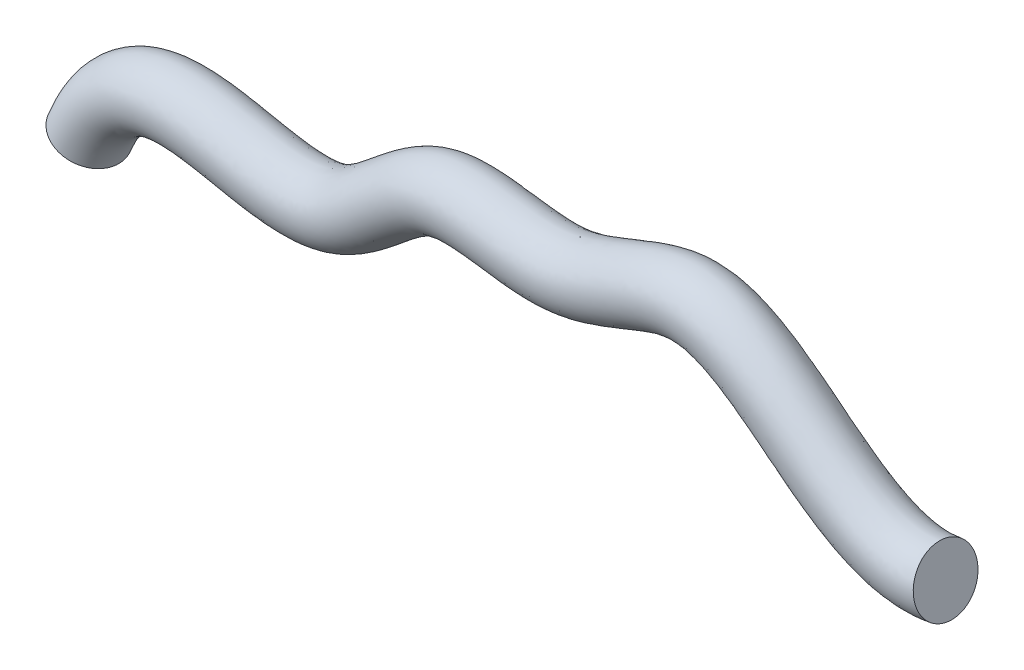
ISO-10303-21;
HEADER;
FILE_DESCRIPTION(('STEP AP214'),'2;1');
FILE_NAME('part.step','',(''),(''),'','','');
FILE_SCHEMA(('AUTOMOTIVE_DESIGN { 1 0 10303 214 1 1 1 1 }'));
ENDSEC;
DATA;
#1=APPLICATION_CONTEXT('core data for automotive mechanical design processes');
#2=APPLICATION_PROTOCOL_DEFINITION('international standard','automotive_design',2000,#1);
#3=PRODUCT_CONTEXT('',#1,'mechanical');
#4=PRODUCT('Part','Part','',(#3));
#5=PRODUCT_RELATED_PRODUCT_CATEGORY('part','',(#4));
#6=PRODUCT_DEFINITION_FORMATION('','',#4);
#7=PRODUCT_DEFINITION_CONTEXT('part definition',#1,'design');
#8=PRODUCT_DEFINITION('design','',#6,#7);
#9=PRODUCT_DEFINITION_SHAPE('','',#8);
#10=(LENGTH_UNIT() NAMED_UNIT(*) SI_UNIT(.MILLI.,.METRE.));
#11=(NAMED_UNIT(*) PLANE_ANGLE_UNIT() SI_UNIT($,.RADIAN.));
#12=(NAMED_UNIT(*) SI_UNIT($,.STERADIAN.) SOLID_ANGLE_UNIT());
#13=UNCERTAINTY_MEASURE_WITH_UNIT(LENGTH_MEASURE(1.E-05),#10,'distance_accuracy_value','');
#14=(GEOMETRIC_REPRESENTATION_CONTEXT(3) GLOBAL_UNCERTAINTY_ASSIGNED_CONTEXT((#13)) GLOBAL_UNIT_ASSIGNED_CONTEXT((#10,
#11,#12)) REPRESENTATION_CONTEXT('',''));
#15=CARTESIAN_POINT('',(0.,0.,0.));
#16=DIRECTION('',(0.,0.,1.));
#17=DIRECTION('',(1.,0.,0.));
#18=AXIS2_PLACEMENT_3D('',#15,#16,#17);
#19=CARTESIAN_POINT('',(0.,0.,0.));
#20=DIRECTION('',(0.380154312529925,0.92492307716096,0.));
#21=DIRECTION('',(-0.924923077160961,0.380154312529925,0.));
#22=AXIS2_PLACEMENT_3D('',#19,#20,#21);
#23=PLANE('',#22);
#24=CARTESIAN_POINT('',(0.,0.,0.));
#25=DIRECTION('',(0.380154312529925,0.92492307716096,0.));
#26=DIRECTION('',(-0.924923077160961,0.380154312529925,0.));
#27=AXIS2_PLACEMENT_3D('',#24,#25,#26);
#28=CIRCLE('',#27,6.);
#29=CARTESIAN_POINT('',(-5.54953846296576,2.28092587517955,0.));
#30=VERTEX_POINT('',#29);
#31=EDGE_CURVE('E60',#30,#30,#28,.T.);
#32=ORIENTED_EDGE('',*,*,#31,.F.);
#33=EDGE_LOOP('',(#32));
#34=FACE_BOUND('',#33,.T.);
#35=ADVANCED_FACE('F53',(#34),#23,.F.);
#36=CARTESIAN_POINT('',(161.410809748428,7.63797169811321,0.));
#37=DIRECTION('',(0.981837483207703,0.189723895617717,0.));
#38=DIRECTION('',(-0.189723895617717,0.981837483207704,0.));
#39=AXIS2_PLACEMENT_3D('',#36,#37,#38);
#40=PLANE('',#39);
#41=CARTESIAN_POINT('',(161.410809748428,7.63797169811321,0.));
#42=DIRECTION('',(0.981837483207703,0.189723895617717,0.));
#43=DIRECTION('',(-0.189723895617717,0.981837483207704,0.));
#44=AXIS2_PLACEMENT_3D('',#41,#42,#43);
#45=CIRCLE('',#44,6.);
#46=CARTESIAN_POINT('',(160.272466374721,13.5289965973594,0.));
#47=VERTEX_POINT('',#46);
#48=EDGE_CURVE('E14',#47,#47,#45,.T.);
#49=ORIENTED_EDGE('',*,*,#48,.T.);
#50=EDGE_LOOP('',(#49));
#51=FACE_BOUND('',#50,.T.);
#52=ADVANCED_FACE('F67',(#51),#40,.T.);
#53=CARTESIAN_POINT('',(-5.54953846296576,2.28092587517955,0.));
#54=CARTESIAN_POINT('',(-4.05394650432709,5.9197311471961,0.));
#55=CARTESIAN_POINT('',(-2.27127602051509,8.95558888652301,0.));
#56=CARTESIAN_POINT('',(1.97369577166759,13.9065280727899,0.));
#57=CARTESIAN_POINT('',(4.45483734387682,15.7958399303868,0.));
#58=CARTESIAN_POINT('',(9.71318338214287,18.3003077448175,0.));
#59=CARTESIAN_POINT('',(12.4466972073246,18.9152571141608,0.));
#60=CARTESIAN_POINT('',(17.6968230004048,19.347301904369,0.));
#61=CARTESIAN_POINT('',(20.2285252951408,19.1831105372652,0.));
#62=CARTESIAN_POINT('',(25.0817149349123,18.5639947189804,0.));
#63=CARTESIAN_POINT('',(27.4104093121296,18.1054305040878,0.));
#64=CARTESIAN_POINT('',(31.8518615572502,17.2138818189594,0.));
#65=CARTESIAN_POINT('',(33.9649007330855,16.7804531587213,0.));
#66=CARTESIAN_POINT('',(37.8695716397061,16.1881415293268,0.));
#67=CARTESIAN_POINT('',(39.6563792009739,16.0330731488971,0.));
#68=CARTESIAN_POINT('',(42.7586887194937,16.1260848181501,0.));
#69=CARTESIAN_POINT('',(44.0559510146421,16.3627263768628,0.));
#70=CARTESIAN_POINT('',(46.166825522029,17.1764753718432,0.));
#71=CARTESIAN_POINT('',(47.3140451223231,17.829228670752,0.));
#72=CARTESIAN_POINT('',(49.8507130285026,19.6193467800492,0.));
#73=CARTESIAN_POINT('',(51.2309017790838,20.7448016478914,0.));
#74=CARTESIAN_POINT('',(54.2107248961869,23.170182522947,0.));
#75=CARTESIAN_POINT('',(55.8102704486552,24.470843087834,0.));
#76=CARTESIAN_POINT('',(59.4100808324285,26.9130710260053,0.));
#77=CARTESIAN_POINT('',(61.4235426110747,28.0678413395493,0.));
#78=CARTESIAN_POINT('',(66.3933666858934,29.7368778882543,0.));
#79=CARTESIAN_POINT('',(68.9905628906182,29.9981415721801,0.));
#80=CARTESIAN_POINT('',(73.8487779425126,29.9857622444218,0.));
#81=CARTESIAN_POINT('',(76.1367418528279,29.7194813241948,0.));
#82=CARTESIAN_POINT('',(80.4575056441381,29.1494255512299,0.));
#83=CARTESIAN_POINT('',(82.4926514863444,28.8422574419128,0.));
#84=CARTESIAN_POINT('',(86.2451318943494,28.4945243905478,0.));
#85=CARTESIAN_POINT('',(87.9528627328252,28.4556614061603,0.));
#86=CARTESIAN_POINT('',(90.9853342003372,28.7914840930561,0.));
#87=CARTESIAN_POINT('',(92.6497766090548,29.2067968698308,0.));
#88=CARTESIAN_POINT('',(96.2183906330377,30.3944874750143,0.));
#89=CARTESIAN_POINT('',(98.1141684715314,31.1630280634922,0.));
#90=CARTESIAN_POINT('',(102.100647811889,32.7650005978023,0.));
#91=CARTESIAN_POINT('',(104.190319642245,33.6002595924596,0.));
#92=CARTESIAN_POINT('',(108.672096673742,34.9565571125371,0.));
#93=CARTESIAN_POINT('',(111.08189477961,35.4867281825557,0.));
#94=CARTESIAN_POINT('',(116.490687656377,35.5815899507079,0.));
#95=CARTESIAN_POINT('',(119.154739997354,35.0476027697183,0.));
#96=CARTESIAN_POINT('',(124.057997906412,33.3302949183876,0.));
#97=CARTESIAN_POINT('',(126.316023771602,32.154938289037,0.));
#98=CARTESIAN_POINT('',(132.732702200472,28.2047664041945,0.));
#99=CARTESIAN_POINT('',(136.583331693293,24.9951288947813,0.));
#100=CARTESIAN_POINT('',(144.040081685357,19.1755547415204,0.));
#101=CARTESIAN_POINT('',(147.63493740145,16.5841968329484,0.));
#102=CARTESIAN_POINT('',(152.619674872267,14.2612626806852,0.));
#103=CARTESIAN_POINT('',(154.199771135786,13.7409504977143,0.));
#104=CARTESIAN_POINT('',(157.238995221851,13.2307982627891,0.));
#105=CARTESIAN_POINT('',(158.69890692067,13.2249321945242,0.));
#106=CARTESIAN_POINT('',(160.272466374721,13.5289965973594,0.));
#107=CARTESIAN_POINT('',(-5.54953846296576,2.28092587517955,12.));
#108=CARTESIAN_POINT('',(-4.05394650432709,5.9197311471961,12.));
#109=CARTESIAN_POINT('',(-2.27127602051509,8.95558888652301,12.));
#110=CARTESIAN_POINT('',(1.97369577166759,13.9065280727899,12.));
#111=CARTESIAN_POINT('',(4.45483734387682,15.7958399303868,12.));
#112=CARTESIAN_POINT('',(9.71318338214287,18.3003077448175,12.));
#113=CARTESIAN_POINT('',(12.4466972073246,18.9152571141608,12.));
#114=CARTESIAN_POINT('',(17.6968230004048,19.347301904369,12.));
#115=CARTESIAN_POINT('',(20.2285252951408,19.1831105372652,12.));
#116=CARTESIAN_POINT('',(25.0817149349123,18.5639947189804,12.));
#117=CARTESIAN_POINT('',(27.4104093121296,18.1054305040878,12.));
#118=CARTESIAN_POINT('',(31.8518615572502,17.2138818189594,12.));
#119=CARTESIAN_POINT('',(33.9649007330855,16.7804531587213,12.));
#120=CARTESIAN_POINT('',(37.8695716397061,16.1881415293268,12.));
#121=CARTESIAN_POINT('',(39.6563792009739,16.0330731488971,12.));
#122=CARTESIAN_POINT('',(42.7586887194937,16.1260848181501,12.));
#123=CARTESIAN_POINT('',(44.0559510146421,16.3627263768628,12.));
#124=CARTESIAN_POINT('',(46.166825522029,17.1764753718432,12.));
#125=CARTESIAN_POINT('',(47.3140451223231,17.829228670752,12.));
#126=CARTESIAN_POINT('',(49.8507130285026,19.6193467800492,12.));
#127=CARTESIAN_POINT('',(51.2309017790838,20.7448016478914,12.));
#128=CARTESIAN_POINT('',(54.2107248961869,23.170182522947,12.));
#129=CARTESIAN_POINT('',(55.8102704486552,24.470843087834,12.));
#130=CARTESIAN_POINT('',(59.4100808324285,26.9130710260054,12.));
#131=CARTESIAN_POINT('',(61.4235426110747,28.0678413395493,12.));
#132=CARTESIAN_POINT('',(66.3933666858934,29.7368778882543,12.));
#133=CARTESIAN_POINT('',(68.9905628906182,29.9981415721801,12.));
#134=CARTESIAN_POINT('',(73.8487779425126,29.9857622444218,12.));
#135=CARTESIAN_POINT('',(76.1367418528279,29.7194813241948,12.));
#136=CARTESIAN_POINT('',(80.4575056441381,29.1494255512299,12.));
#137=CARTESIAN_POINT('',(82.4926514863444,28.8422574419128,12.));
#138=CARTESIAN_POINT('',(86.2451318943494,28.4945243905478,12.));
#139=CARTESIAN_POINT('',(87.9528627328252,28.4556614061603,12.));
#140=CARTESIAN_POINT('',(90.9853342003372,28.7914840930561,12.));
#141=CARTESIAN_POINT('',(92.6497766090548,29.2067968698308,12.));
#142=CARTESIAN_POINT('',(96.2183906330377,30.3944874750143,12.));
#143=CARTESIAN_POINT('',(98.1141684715314,31.1630280634922,12.));
#144=CARTESIAN_POINT('',(102.100647811889,32.7650005978023,12.));
#145=CARTESIAN_POINT('',(104.190319642245,33.6002595924596,12.));
#146=CARTESIAN_POINT('',(108.672096673742,34.9565571125371,12.));
#147=CARTESIAN_POINT('',(111.08189477961,35.4867281825557,12.));
#148=CARTESIAN_POINT('',(116.490687656377,35.5815899507079,12.));
#149=CARTESIAN_POINT('',(119.154739997354,35.0476027697183,12.));
#150=CARTESIAN_POINT('',(124.057997906412,33.3302949183876,12.));
#151=CARTESIAN_POINT('',(126.316023771602,32.154938289037,12.));
#152=CARTESIAN_POINT('',(132.732702200472,28.2047664041945,12.));
#153=CARTESIAN_POINT('',(136.583331693293,24.9951288947813,12.));
#154=CARTESIAN_POINT('',(144.040081685357,19.1755547415204,12.));
#155=CARTESIAN_POINT('',(147.63493740145,16.5841968329484,12.));
#156=CARTESIAN_POINT('',(152.619674872267,14.2612626806852,12.));
#157=CARTESIAN_POINT('',(154.199771135786,13.7409504977143,12.));
#158=CARTESIAN_POINT('',(157.238995221851,13.2307982627891,12.));
#159=CARTESIAN_POINT('',(158.69890692067,13.2249321945242,12.));
#160=CARTESIAN_POINT('',(160.272466374721,13.5289965973594,12.));
#161=CARTESIAN_POINT('',(5.54953846296576,-2.28092587517955,12.));
#162=CARTESIAN_POINT('',(6.66086181957784,0.42294616759574,12.));
#163=CARTESIAN_POINT('',(7.83893474589073,2.31138602919408,12.));
#164=CARTESIAN_POINT('',(10.0832618346369,4.92895983053584,12.));
#165=CARTESIAN_POINT('',(11.1306757350517,5.68386335233977,12.));
#166=CARTESIAN_POINT('',(13.3574085710458,6.7444213063335,12.));
#167=CARTESIAN_POINT('',(14.5804181509286,7.05028231232083,12.));
#168=CARTESIAN_POINT('',(17.531462967316,7.29313049807774,12.));
#169=CARTESIAN_POINT('',(19.2444078806115,7.21140445151,12.));
#170=CARTESIAN_POINT('',(23.0287923272485,6.72863488086346,12.));
#171=CARTESIAN_POINT('',(25.0930248317381,6.33123110731123,12.));
#172=CARTESIAN_POINT('',(29.4458618914796,5.45747046701573,12.));
#173=CARTESIAN_POINT('',(31.7341851419387,4.98155777775215,12.));
#174=CARTESIAN_POINT('',(36.5008304999594,4.25849057381702,12.));
#175=CARTESIAN_POINT('',(38.9839767804076,4.00752145736383,12.));
#176=CARTESIAN_POINT('',(44.1503222279771,4.16241587536152,12.));
#177=CARTESIAN_POINT('',(46.8517610598682,4.57971788990077,12.));
#178=CARTESIAN_POINT('',(51.7874661322944,6.4824482590694,12.));
#179=CARTESIAN_POINT('',(53.7424581552721,7.67856292205418,12.));
#180=CARTESIAN_POINT('',(57.2602665511661,10.1610686100718,12.));
#181=CARTESIAN_POINT('',(58.8323424751399,11.459369594872,12.));
#182=CARTESIAN_POINT('',(61.7595853156794,13.8419535683029,12.));
#183=CARTESIAN_POINT('',(63.1148410414629,14.9255020185474,12.));
#184=CARTESIAN_POINT('',(65.5796533746702,16.5977105272154,12.));
#185=CARTESIAN_POINT('',(66.6760130304384,17.1731676624472,12.));
#186=CARTESIAN_POINT('',(68.6143505513865,17.8241275607455,12.));
#187=CARTESIAN_POINT('',(69.8534905352246,17.9959037707055,12.));
#188=CARTESIAN_POINT('',(72.9246955242347,17.9880779607383,12.));
#189=CARTESIAN_POINT('',(74.7298154689077,17.8011138337668,12.));
#190=CARTESIAN_POINT('',(78.7252189520828,17.2739841564956,12.));
#191=CARTESIAN_POINT('',(80.9131565323909,16.9372118449987,12.));
#192=CARTESIAN_POINT('',(85.6100944360402,16.501958261705,12.));
#193=CARTESIAN_POINT('',(88.1286984893806,16.401775017794,12.));
#194=CARTESIAN_POINT('',(93.4609321476652,16.9922785242298,12.));
#195=CARTESIAN_POINT('',(95.9338018146029,17.6526243090322,12.));
#196=CARTESIAN_POINT('',(100.513221264808,19.1767267802208,12.));
#197=CARTESIAN_POINT('',(102.628164825114,20.0443207197073,12.));
#198=CARTESIAN_POINT('',(106.535559877274,21.6145131175948,12.));
#199=CARTESIAN_POINT('',(108.329041040668,22.3152845437181,12.));
#200=CARTESIAN_POINT('',(111.485023863439,23.2703636688553,12.));
#201=CARTESIAN_POINT('',(112.829832617791,23.5155388390067,12.));
#202=CARTESIAN_POINT('',(115.056875153191,23.5545976843612,12.));
#203=CARTESIAN_POINT('',(116.264747850927,23.3450718802742,12.));
#204=CARTESIAN_POINT('',(119.014774918198,22.3819075565222,12.));
#205=CARTESIAN_POINT('',(120.538108989149,21.6203049874574,12.));
#206=CARTESIAN_POINT('',(125.416011393081,18.6174191239304,12.));
#207=CARTESIAN_POINT('',(129.029103817226,15.6687779003246,12.));
#208=CARTESIAN_POINT('',(136.828326658359,9.58192294247595,12.));
#209=CARTESIAN_POINT('',(141.025721856606,6.42513045558611,12.));
#210=CARTESIAN_POINT('',(148.321152211146,3.0253918715938,12.));
#211=CARTESIAN_POINT('',(150.933077130728,2.12140527825292,12.));
#212=CARTESIAN_POINT('',(156.532725013068,1.18147034989488,12.));
#213=CARTESIAN_POINT('',(159.519664099595,1.16154802585296,12.));
#214=CARTESIAN_POINT('',(162.549153122134,1.74694679886699,12.));
#215=CARTESIAN_POINT('',(5.54953846296576,-2.28092587517955,0.));
#216=CARTESIAN_POINT('',(6.66086181957785,0.422946167595739,0.));
#217=CARTESIAN_POINT('',(7.83893474589073,2.31138602919408,0.));
#218=CARTESIAN_POINT('',(10.0832618346369,4.92895983053584,0.));
#219=CARTESIAN_POINT('',(11.1306757350508,5.68386335233976,0.));
#220=CARTESIAN_POINT('',(13.3574085710467,6.7444213063335,0.));
#221=CARTESIAN_POINT('',(14.5804181509268,7.05028231232083,0.));
#222=CARTESIAN_POINT('',(17.5314629673178,7.29313049807774,0.));
#223=CARTESIAN_POINT('',(19.2444078806115,7.21140445151,0.));
#224=CARTESIAN_POINT('',(23.0287923272485,6.72863488086346,0.));
#225=CARTESIAN_POINT('',(25.0930248317381,6.33123110731123,0.));
#226=CARTESIAN_POINT('',(29.4458618914796,5.45747046701573,0.));
#227=CARTESIAN_POINT('',(31.7341851419387,4.98155777775215,0.));
#228=CARTESIAN_POINT('',(36.5008304999594,4.25849057381702,0.));
#229=CARTESIAN_POINT('',(38.983976780404,4.00752145736338,0.));
#230=CARTESIAN_POINT('',(44.1503222279807,4.16241587536196,0.));
#231=CARTESIAN_POINT('',(46.8517610598682,4.57971788990032,0.));
#232=CARTESIAN_POINT('',(51.7874661322944,6.48244825906978,0.));
#233=CARTESIAN_POINT('',(53.7424581552721,7.67856292205418,0.));
#234=CARTESIAN_POINT('',(57.2602665511661,10.1610686100718,0.));
#235=CARTESIAN_POINT('',(58.8323424751399,11.459369594872,0.));
#236=CARTESIAN_POINT('',(61.7595853156794,13.8419535683029,0.));
#237=CARTESIAN_POINT('',(63.1148410414693,14.9255020185458,0.));
#238=CARTESIAN_POINT('',(65.5796533746638,16.597710527217,0.));
#239=CARTESIAN_POINT('',(66.6760130304384,17.1731676624472,0.));
#240=CARTESIAN_POINT('',(68.6143505513865,17.8241275607455,0.));
#241=CARTESIAN_POINT('',(69.8534905352246,17.9959037707055,0.));
#242=CARTESIAN_POINT('',(72.9246955242347,17.9880779607383,0.));
#243=CARTESIAN_POINT('',(74.7298154689077,17.801113833765,0.));
#244=CARTESIAN_POINT('',(78.7252189520828,17.2739841564975,0.));
#245=CARTESIAN_POINT('',(80.9131565323909,16.9372118449987,0.));
#246=CARTESIAN_POINT('',(85.6100944360402,16.501958261705,0.));
#247=CARTESIAN_POINT('',(88.1286984893806,16.401775017794,0.));
#248=CARTESIAN_POINT('',(93.4609321476652,16.9922785242298,0.));
#249=CARTESIAN_POINT('',(95.9338018146028,17.6526243090322,0.));
#250=CARTESIAN_POINT('',(100.513221264808,19.1767267802208,0.));
#251=CARTESIAN_POINT('',(102.628164825121,20.0443207197073,0.));
#252=CARTESIAN_POINT('',(106.535559877267,21.6145131175948,0.));
#253=CARTESIAN_POINT('',(108.329041040661,22.3152845437147,0.));
#254=CARTESIAN_POINT('',(111.485023863446,23.2703636688588,0.));
#255=CARTESIAN_POINT('',(112.829832617791,23.5155388390067,0.));
#256=CARTESIAN_POINT('',(115.056875153191,23.5545976843612,0.));
#257=CARTESIAN_POINT('',(116.264747850927,23.3450718802725,0.));
#258=CARTESIAN_POINT('',(119.014774918198,22.3819075565239,0.));
#259=CARTESIAN_POINT('',(120.538108989142,21.6203049874574,0.));
#260=CARTESIAN_POINT('',(125.416011393097,18.6174191239304,0.));
#261=CARTESIAN_POINT('',(129.029103817226,15.6687779003246,0.));
#262=CARTESIAN_POINT('',(136.828326658359,9.58192294247595,0.));
#263=CARTESIAN_POINT('',(141.025721856606,6.42513045558611,0.));
#264=CARTESIAN_POINT('',(148.321152211146,3.0253918715938,0.));
#265=CARTESIAN_POINT('',(150.933077130728,2.12140527825387,0.));
#266=CARTESIAN_POINT('',(156.532725013068,1.18147034989393,0.));
#267=CARTESIAN_POINT('',(159.519664099595,1.16154802585601,0.));
#268=CARTESIAN_POINT('',(162.549153122134,1.74694679886698,0.));
#269=CARTESIAN_POINT('',(5.54953846296577,-2.28092587517955,-12.));
#270=CARTESIAN_POINT('',(6.66086181957785,0.422946167595739,-12.));
#271=CARTESIAN_POINT('',(7.83893474589074,2.31138602919408,-12.));
#272=CARTESIAN_POINT('',(10.0832618346369,4.92895983053584,-12.));
#273=CARTESIAN_POINT('',(11.1306757350499,5.68386335233976,-12.));
#274=CARTESIAN_POINT('',(13.3574085710476,6.7444213063335,-12.));
#275=CARTESIAN_POINT('',(14.5804181509251,7.05028231232083,-12.));
#276=CARTESIAN_POINT('',(17.5314629673195,7.29313049807774,-12.));
#277=CARTESIAN_POINT('',(19.2444078806115,7.21140445151,-12.));
#278=CARTESIAN_POINT('',(23.0287923272485,6.72863488086346,-12.));
#279=CARTESIAN_POINT('',(25.0930248317381,6.33123110731123,-12.));
#280=CARTESIAN_POINT('',(29.4458618914796,5.45747046701573,-12.));
#281=CARTESIAN_POINT('',(31.7341851419387,4.98155777775215,-12.));
#282=CARTESIAN_POINT('',(36.5008304999594,4.25849057381702,-12.));
#283=CARTESIAN_POINT('',(38.9839767804004,4.00752145736293,-12.));
#284=CARTESIAN_POINT('',(44.1503222279842,4.16241587536241,-12.));
#285=CARTESIAN_POINT('',(46.8517610598682,4.57971788989988,-12.));
#286=CARTESIAN_POINT('',(51.7874661322944,6.48244825907015,-12.));
#287=CARTESIAN_POINT('',(53.7424581552721,7.67856292205417,-12.));
#288=CARTESIAN_POINT('',(57.2602665511661,10.1610686100718,-12.));
#289=CARTESIAN_POINT('',(58.8323424751399,11.459369594872,-12.));
#290=CARTESIAN_POINT('',(61.7595853156794,13.8419535683029,-12.));
#291=CARTESIAN_POINT('',(63.1148410414756,14.9255020185442,-12.));
#292=CARTESIAN_POINT('',(65.5796533746575,16.5977105272186,-12.));
#293=CARTESIAN_POINT('',(66.6760130304384,17.1731676624472,-12.));
#294=CARTESIAN_POINT('',(68.6143505513865,17.8241275607455,-12.));
#295=CARTESIAN_POINT('',(69.8534905352246,17.9959037707055,-12.));
#296=CARTESIAN_POINT('',(72.9246955242347,17.9880779607383,-12.));
#297=CARTESIAN_POINT('',(74.7298154689077,17.8011138337632,-12.));
#298=CARTESIAN_POINT('',(78.7252189520828,17.2739841564993,-12.));
#299=CARTESIAN_POINT('',(80.9131565323909,16.9372118449987,-12.));
#300=CARTESIAN_POINT('',(85.6100944360402,16.501958261705,-12.));
#301=CARTESIAN_POINT('',(88.1286984893806,16.401775017794,-12.));
#302=CARTESIAN_POINT('',(93.4609321476652,16.9922785242298,-12.));
#303=CARTESIAN_POINT('',(95.9338018146029,17.6526243090322,-12.));
#304=CARTESIAN_POINT('',(100.513221264808,19.1767267802208,-12.));
#305=CARTESIAN_POINT('',(102.628164825128,20.0443207197073,-12.));
#306=CARTESIAN_POINT('',(106.53555987726,21.6145131175948,-12.));
#307=CARTESIAN_POINT('',(108.329041040654,22.3152845437112,-12.));
#308=CARTESIAN_POINT('',(111.485023863453,23.2703636688622,-12.));
#309=CARTESIAN_POINT('',(112.829832617791,23.5155388390067,-12.));
#310=CARTESIAN_POINT('',(115.056875153191,23.5545976843612,-12.));
#311=CARTESIAN_POINT('',(116.264747850927,23.3450718802707,-12.));
#312=CARTESIAN_POINT('',(119.014774918198,22.3819075565257,-12.));
#313=CARTESIAN_POINT('',(120.538108989134,21.6203049874574,-12.));
#314=CARTESIAN_POINT('',(125.416011393112,18.6174191239304,-12.));
#315=CARTESIAN_POINT('',(129.029103817226,15.6687779003246,-12.));
#316=CARTESIAN_POINT('',(136.828326658359,9.58192294247595,-12.));
#317=CARTESIAN_POINT('',(141.025721856606,6.42513045558611,-12.));
#318=CARTESIAN_POINT('',(148.321152211146,3.0253918715938,-12.));
#319=CARTESIAN_POINT('',(150.933077130728,2.12140527825481,-12.));
#320=CARTESIAN_POINT('',(156.532725013068,1.18147034989298,-12.));
#321=CARTESIAN_POINT('',(159.519664099595,1.16154802585906,-12.));
#322=CARTESIAN_POINT('',(162.549153122134,1.74694679886698,-12.));
#323=CARTESIAN_POINT('',(-5.54953846296576,2.28092587517955,-12.));
#324=CARTESIAN_POINT('',(-4.05394650432709,5.9197311471961,-12.));
#325=CARTESIAN_POINT('',(-2.27127602051509,8.95558888652301,-12.));
#326=CARTESIAN_POINT('',(1.97369577166759,13.9065280727899,-12.));
#327=CARTESIAN_POINT('',(4.45483734387682,15.7958399303868,-12.));
#328=CARTESIAN_POINT('',(9.71318338214287,18.3003077448175,-12.));
#329=CARTESIAN_POINT('',(12.4466972073246,18.9152571141608,-12.));
#330=CARTESIAN_POINT('',(17.6968230004048,19.347301904369,-12.));
#331=CARTESIAN_POINT('',(20.2285252951408,19.1831105372652,-12.));
#332=CARTESIAN_POINT('',(25.0817149349123,18.5639947189804,-12.));
#333=CARTESIAN_POINT('',(27.4104093121296,18.1054305040878,-12.));
#334=CARTESIAN_POINT('',(31.8518615572502,17.2138818189594,-12.));
#335=CARTESIAN_POINT('',(33.9649007330855,16.7804531587213,-12.));
#336=CARTESIAN_POINT('',(37.8695716397061,16.1881415293268,-12.));
#337=CARTESIAN_POINT('',(39.6563792009739,16.0330731488971,-12.));
#338=CARTESIAN_POINT('',(42.7586887194937,16.1260848181501,-12.));
#339=CARTESIAN_POINT('',(44.0559510146421,16.3627263768628,-12.));
#340=CARTESIAN_POINT('',(46.166825522029,17.1764753718432,-12.));
#341=CARTESIAN_POINT('',(47.3140451223231,17.829228670752,-12.));
#342=CARTESIAN_POINT('',(49.8507130285026,19.6193467800492,-12.));
#343=CARTESIAN_POINT('',(51.2309017790838,20.7448016478914,-12.));
#344=CARTESIAN_POINT('',(54.2107248961869,23.170182522947,-12.));
#345=CARTESIAN_POINT('',(55.8102704486552,24.470843087834,-12.));
#346=CARTESIAN_POINT('',(59.4100808324285,26.9130710260054,-12.));
#347=CARTESIAN_POINT('',(61.4235426110747,28.0678413395493,-12.));
#348=CARTESIAN_POINT('',(66.3933666858934,29.7368778882543,-12.));
#349=CARTESIAN_POINT('',(68.9905628906182,29.9981415721801,-12.));
#350=CARTESIAN_POINT('',(73.8487779425126,29.9857622444218,-12.));
#351=CARTESIAN_POINT('',(76.1367418528279,29.7194813241948,-12.));
#352=CARTESIAN_POINT('',(80.4575056441381,29.1494255512299,-12.));
#353=CARTESIAN_POINT('',(82.4926514863444,28.8422574419128,-12.));
#354=CARTESIAN_POINT('',(86.2451318943494,28.4945243905478,-12.));
#355=CARTESIAN_POINT('',(87.9528627328252,28.4556614061603,-12.));
#356=CARTESIAN_POINT('',(90.9853342003372,28.7914840930561,-12.));
#357=CARTESIAN_POINT('',(92.6497766090548,29.2067968698308,-12.));
#358=CARTESIAN_POINT('',(96.2183906330377,30.3944874750143,-12.));
#359=CARTESIAN_POINT('',(98.1141684715314,31.1630280634922,-12.));
#360=CARTESIAN_POINT('',(102.100647811889,32.7650005978023,-12.));
#361=CARTESIAN_POINT('',(104.190319642245,33.6002595924596,-12.));
#362=CARTESIAN_POINT('',(108.672096673742,34.9565571125371,-12.));
#363=CARTESIAN_POINT('',(111.08189477961,35.4867281825557,-12.));
#364=CARTESIAN_POINT('',(116.490687656377,35.5815899507079,-12.));
#365=CARTESIAN_POINT('',(119.154739997354,35.0476027697183,-12.));
#366=CARTESIAN_POINT('',(124.057997906412,33.3302949183876,-12.));
#367=CARTESIAN_POINT('',(126.316023771602,32.154938289037,-12.));
#368=CARTESIAN_POINT('',(132.732702200472,28.2047664041945,-12.));
#369=CARTESIAN_POINT('',(136.583331693293,24.9951288947813,-12.));
#370=CARTESIAN_POINT('',(144.040081685357,19.1755547415204,-12.));
#371=CARTESIAN_POINT('',(147.63493740145,16.5841968329484,-12.));
#372=CARTESIAN_POINT('',(152.619674872267,14.2612626806852,-12.));
#373=CARTESIAN_POINT('',(154.199771135786,13.7409504977143,-12.));
#374=CARTESIAN_POINT('',(157.238995221851,13.2307982627891,-12.));
#375=CARTESIAN_POINT('',(158.69890692067,13.2249321945242,-12.));
#376=CARTESIAN_POINT('',(160.272466374721,13.5289965973594,-12.));
#377=CARTESIAN_POINT('',(-5.54953846296576,2.28092587517955,0.));
#378=CARTESIAN_POINT('',(-4.05394650432709,5.9197311471961,0.));
#379=CARTESIAN_POINT('',(-2.27127602051509,8.95558888652301,0.));
#380=CARTESIAN_POINT('',(1.97369577166759,13.9065280727899,0.));
#381=CARTESIAN_POINT('',(4.45483734387682,15.7958399303868,0.));
#382=CARTESIAN_POINT('',(9.71318338214287,18.3003077448175,0.));
#383=CARTESIAN_POINT('',(12.4466972073246,18.9152571141608,0.));
#384=CARTESIAN_POINT('',(17.6968230004048,19.347301904369,0.));
#385=CARTESIAN_POINT('',(20.2285252951408,19.1831105372652,0.));
#386=CARTESIAN_POINT('',(25.0817149349123,18.5639947189804,0.));
#387=CARTESIAN_POINT('',(27.4104093121296,18.1054305040878,0.));
#388=CARTESIAN_POINT('',(31.8518615572502,17.2138818189594,0.));
#389=CARTESIAN_POINT('',(33.9649007330855,16.7804531587213,0.));
#390=CARTESIAN_POINT('',(37.8695716397061,16.1881415293268,0.));
#391=CARTESIAN_POINT('',(39.6563792009739,16.0330731488971,0.));
#392=CARTESIAN_POINT('',(42.7586887194937,16.1260848181501,0.));
#393=CARTESIAN_POINT('',(44.0559510146421,16.3627263768628,0.));
#394=CARTESIAN_POINT('',(46.166825522029,17.1764753718432,0.));
#395=CARTESIAN_POINT('',(47.3140451223231,17.829228670752,0.));
#396=CARTESIAN_POINT('',(49.8507130285026,19.6193467800492,0.));
#397=CARTESIAN_POINT('',(51.2309017790838,20.7448016478914,0.));
#398=CARTESIAN_POINT('',(54.2107248961869,23.170182522947,0.));
#399=CARTESIAN_POINT('',(55.8102704486552,24.470843087834,0.));
#400=CARTESIAN_POINT('',(59.4100808324285,26.9130710260053,0.));
#401=CARTESIAN_POINT('',(61.4235426110747,28.0678413395493,0.));
#402=CARTESIAN_POINT('',(66.3933666858934,29.7368778882543,0.));
#403=CARTESIAN_POINT('',(68.9905628906182,29.9981415721801,0.));
#404=CARTESIAN_POINT('',(73.8487779425126,29.9857622444218,0.));
#405=CARTESIAN_POINT('',(76.1367418528279,29.7194813241948,0.));
#406=CARTESIAN_POINT('',(80.4575056441381,29.1494255512299,0.));
#407=CARTESIAN_POINT('',(82.4926514863444,28.8422574419128,0.));
#408=CARTESIAN_POINT('',(86.2451318943494,28.4945243905478,0.));
#409=CARTESIAN_POINT('',(87.9528627328252,28.4556614061603,0.));
#410=CARTESIAN_POINT('',(90.9853342003372,28.7914840930561,0.));
#411=CARTESIAN_POINT('',(92.6497766090548,29.2067968698308,0.));
#412=CARTESIAN_POINT('',(96.2183906330377,30.3944874750143,0.));
#413=CARTESIAN_POINT('',(98.1141684715314,31.1630280634922,0.));
#414=CARTESIAN_POINT('',(102.100647811889,32.7650005978023,0.));
#415=CARTESIAN_POINT('',(104.190319642245,33.6002595924596,0.));
#416=CARTESIAN_POINT('',(108.672096673742,34.9565571125371,0.));
#417=CARTESIAN_POINT('',(111.08189477961,35.4867281825557,0.));
#418=CARTESIAN_POINT('',(116.490687656377,35.5815899507079,0.));
#419=CARTESIAN_POINT('',(119.154739997354,35.0476027697183,0.));
#420=CARTESIAN_POINT('',(124.057997906412,33.3302949183876,0.));
#421=CARTESIAN_POINT('',(126.316023771602,32.154938289037,0.));
#422=CARTESIAN_POINT('',(132.732702200472,28.2047664041945,0.));
#423=CARTESIAN_POINT('',(136.583331693293,24.9951288947813,0.));
#424=CARTESIAN_POINT('',(144.040081685357,19.1755547415204,0.));
#425=CARTESIAN_POINT('',(147.63493740145,16.5841968329484,0.));
#426=CARTESIAN_POINT('',(152.619674872267,14.2612626806852,0.));
#427=CARTESIAN_POINT('',(154.199771135786,13.7409504977143,0.));
#428=CARTESIAN_POINT('',(157.238995221851,13.2307982627891,0.));
#429=CARTESIAN_POINT('',(158.69890692067,13.2249321945242,0.));
#430=CARTESIAN_POINT('',(160.272466374721,13.5289965973594,0.));
#431=(BOUNDED_SURFACE() B_SPLINE_SURFACE(3,3,((#53,#54,#55,#56,#57,#58,#59,#60,#61,#62,#63,#64,
#65,#66,#67,#68,#69,#70,#71,#72,#73,#74,#75,#76,#77,#78,#79,#80,#81,#82,#83,#84,#85,#86,#87,#88,
#89,#90,#91,#92,#93,#94,#95,#96,#97,#98,#99,#100,#101,#102,#103,#104,#105,#106),(#107,#108,#109,
#110,#111,#112,#113,#114,#115,#116,#117,#118,#119,#120,#121,#122,#123,#124,#125,#126,#127,#128,
#129,#130,#131,#132,#133,#134,#135,#136,#137,#138,#139,#140,#141,#142,#143,#144,#145,#146,#147,
#148,#149,#150,#151,#152,#153,#154,#155,#156,#157,#158,#159,#160),(#161,#162,#163,#164,#165,
#166,#167,#168,#169,#170,#171,#172,#173,#174,#175,#176,#177,#178,#179,#180,#181,#182,#183,#184,
#185,#186,#187,#188,#189,#190,#191,#192,#193,#194,#195,#196,#197,#198,#199,#200,#201,#202,#203,
#204,#205,#206,#207,#208,#209,#210,#211,#212,#213,#214),(#215,#216,#217,#218,#219,#220,#221,
#222,#223,#224,#225,#226,#227,#228,#229,#230,#231,#232,#233,#234,#235,#236,#237,#238,#239,#240,
#241,#242,#243,#244,#245,#246,#247,#248,#249,#250,#251,#252,#253,#254,#255,#256,#257,#258,#259,
#260,#261,#262,#263,#264,#265,#266,#267,#268),(#269,#270,#271,#272,#273,#274,#275,#276,#277,
#278,#279,#280,#281,#282,#283,#284,#285,#286,#287,#288,#289,#290,#291,#292,#293,#294,#295,#296,
#297,#298,#299,#300,#301,#302,#303,#304,#305,#306,#307,#308,#309,#310,#311,#312,#313,#314,#315,
#316,#317,#318,#319,#320,#321,#322),(#323,#324,#325,#326,#327,#328,#329,#330,#331,#332,#333,
#334,#335,#336,#337,#338,#339,#340,#341,#342,#343,#344,#345,#346,#347,#348,#349,#350,#351,#352,
#353,#354,#355,#356,#357,#358,#359,#360,#361,#362,#363,#364,#365,#366,#367,#368,#369,#370,#371,
#372,#373,#374,#375,#376),(#377,#378,#379,#380,#381,#382,#383,#384,#385,#386,#387,#388,#389,
#390,#391,#392,#393,#394,#395,#396,#397,#398,#399,#400,#401,#402,#403,#404,#405,#406,#407,#408,
#409,#410,#411,#412,#413,#414,#415,#416,#417,#418,#419,#420,#421,#422,#423,#424,#425,#426,#427,
#428,#429,#430)),.UNSPECIFIED.,.T.,.F.,.F.) B_SPLINE_SURFACE_WITH_KNOTS((4,3,4),(4,2,2,2,2,2,2,
2,2,2,2,2,2,2,2,2,2,2,2,2,2,2,2,2,2,2,4),(0.,0.5,1.),(0.,0.0365084340236108,0.0730168680472217,
0.109525302070832,0.146033736094443,0.182542170118054,0.219050604141665,0.255559038165276,
0.292067472188887,0.323381139109945,0.354694806031004,0.386008472952062,0.41732213987312,
0.452291608665795,0.48726107745847,0.522230546251145,0.55720001504382,0.592467840993557,
0.627735666943293,0.66300349289303,0.698271318842766,0.735987403987421,0.773703489132075,
0.849135659421383,0.924567829710692,0.962283914855346,1.),
.UNSPECIFIED.) GEOMETRIC_REPRESENTATION_ITEM() RATIONAL_B_SPLINE_SURFACE(((1.,1.,1.,1.,1.,1.,1.,
1.,1.,1.,1.,1.,1.,1.,1.,1.,1.,1.,1.,1.,1.,1.,1.,1.,1.,1.,1.,1.,1.,1.,1.,1.,1.,1.,1.,1.,1.,1.,1.,
1.,1.,1.,1.,1.,1.,1.,1.,1.,1.,1.,1.,1.,1.,1.),(0.333333333333333,0.333333333333333,
0.333333333333333,0.333333333333333,0.333333333333333,0.333333333333333,0.333333333333333,
0.333333333333333,0.333333333333333,0.333333333333333,0.333333333333333,0.333333333333333,
0.333333333333333,0.333333333333333,0.333333333333333,0.333333333333333,0.333333333333333,
0.333333333333333,0.333333333333333,0.333333333333333,0.333333333333333,0.333333333333333,
0.333333333333333,0.333333333333333,0.333333333333333,0.333333333333333,0.333333333333333,
0.333333333333333,0.333333333333333,0.333333333333333,0.333333333333333,0.333333333333333,
0.333333333333333,0.333333333333333,0.333333333333333,0.333333333333333,0.333333333333333,
0.333333333333333,0.333333333333333,0.333333333333333,0.333333333333333,0.333333333333333,
0.333333333333333,0.333333333333333,0.333333333333333,0.333333333333333,0.333333333333333,
0.333333333333333,0.333333333333333,0.333333333333333,0.333333333333333,0.333333333333333,
0.333333333333333,0.333333333333333),(0.333333333333333,0.333333333333333,0.333333333333333,
0.333333333333333,0.333333333333333,0.333333333333333,0.333333333333333,0.333333333333333,
0.333333333333333,0.333333333333333,0.333333333333333,0.333333333333333,0.333333333333333,
0.333333333333333,0.333333333333333,0.333333333333333,0.333333333333333,0.333333333333333,
0.333333333333333,0.333333333333333,0.333333333333333,0.333333333333333,0.333333333333333,
0.333333333333333,0.333333333333333,0.333333333333333,0.333333333333333,0.333333333333333,
0.333333333333333,0.333333333333333,0.333333333333333,0.333333333333333,0.333333333333333,
0.333333333333333,0.333333333333333,0.333333333333333,0.333333333333333,0.333333333333333,
0.333333333333333,0.333333333333333,0.333333333333333,0.333333333333333,0.333333333333333,
0.333333333333333,0.333333333333333,0.333333333333333,0.333333333333333,0.333333333333333,
0.333333333333333,0.333333333333333,0.333333333333333,0.333333333333333,0.333333333333333,
0.333333333333333),(1.,1.,1.,1.,1.,1.,1.,1.,1.,1.,1.,1.,1.,1.,1.,1.,1.,1.,1.,1.,1.,1.,1.,1.,1.,
1.,1.,1.,1.,1.,1.,1.,1.,1.,1.,1.,1.,1.,1.,1.,1.,1.,1.,1.,1.,1.,1.,1.,1.,1.,1.,1.,1.,1.),
(0.333333333333333,0.333333333333333,0.333333333333333,0.333333333333333,0.333333333333333,
0.333333333333333,0.333333333333333,0.333333333333333,0.333333333333333,0.333333333333333,
0.333333333333333,0.333333333333333,0.333333333333333,0.333333333333333,0.333333333333333,
0.333333333333333,0.333333333333333,0.333333333333333,0.333333333333333,0.333333333333333,
0.333333333333333,0.333333333333333,0.333333333333333,0.333333333333333,0.333333333333333,
0.333333333333333,0.333333333333333,0.333333333333333,0.333333333333333,0.333333333333333,
0.333333333333333,0.333333333333333,0.333333333333333,0.333333333333333,0.333333333333333,
0.333333333333333,0.333333333333333,0.333333333333333,0.333333333333333,0.333333333333333,
0.333333333333333,0.333333333333333,0.333333333333333,0.333333333333333,0.333333333333333,
0.333333333333333,0.333333333333333,0.333333333333333,0.333333333333333,0.333333333333333,
0.333333333333333,0.333333333333333,0.333333333333333,0.333333333333333),(0.333333333333333,
0.333333333333333,0.333333333333333,0.333333333333333,0.333333333333333,0.333333333333333,
0.333333333333333,0.333333333333333,0.333333333333333,0.333333333333333,0.333333333333333,
0.333333333333333,0.333333333333333,0.333333333333333,0.333333333333333,0.333333333333333,
0.333333333333333,0.333333333333333,0.333333333333333,0.333333333333333,0.333333333333333,
0.333333333333333,0.333333333333333,0.333333333333333,0.333333333333333,0.333333333333333,
0.333333333333333,0.333333333333333,0.333333333333333,0.333333333333333,0.333333333333333,
0.333333333333333,0.333333333333333,0.333333333333333,0.333333333333333,0.333333333333333,
0.333333333333333,0.333333333333333,0.333333333333333,0.333333333333333,0.333333333333333,
0.333333333333333,0.333333333333333,0.333333333333333,0.333333333333333,0.333333333333333,
0.333333333333333,0.333333333333333,0.333333333333333,0.333333333333333,0.333333333333333,
0.333333333333333,0.333333333333333,0.333333333333333),(1.,1.,1.,1.,1.,1.,1.,1.,1.,1.,1.,1.,1.,
1.,1.,1.,1.,1.,1.,1.,1.,1.,1.,1.,1.,1.,1.,1.,1.,1.,1.,1.,1.,1.,1.,1.,1.,1.,1.,1.,1.,1.,1.,1.,1.,
1.,1.,1.,1.,1.,1.,1.,1.,1.))) REPRESENTATION_ITEM('') SURFACE());
#432=ORIENTED_EDGE('',*,*,#48,.F.);
#433=EDGE_LOOP('',(#432));
#434=FACE_BOUND('',#433,.T.);
#435=ORIENTED_EDGE('',*,*,#31,.T.);
#436=EDGE_LOOP('',(#435));
#437=FACE_BOUND('',#436,.T.);
#438=ADVANCED_FACE('F69',(#434,#437),#431,.T.);
#439=CLOSED_SHELL('',(#35,#52,#438));
#440=MANIFOLD_SOLID_BREP('B2',#439);
#441=ADVANCED_BREP_SHAPE_REPRESENTATION('',(#18,#440),#14);
#442=SHAPE_DEFINITION_REPRESENTATION(#9,#441);
ENDSEC;
END-ISO-10303-21;
